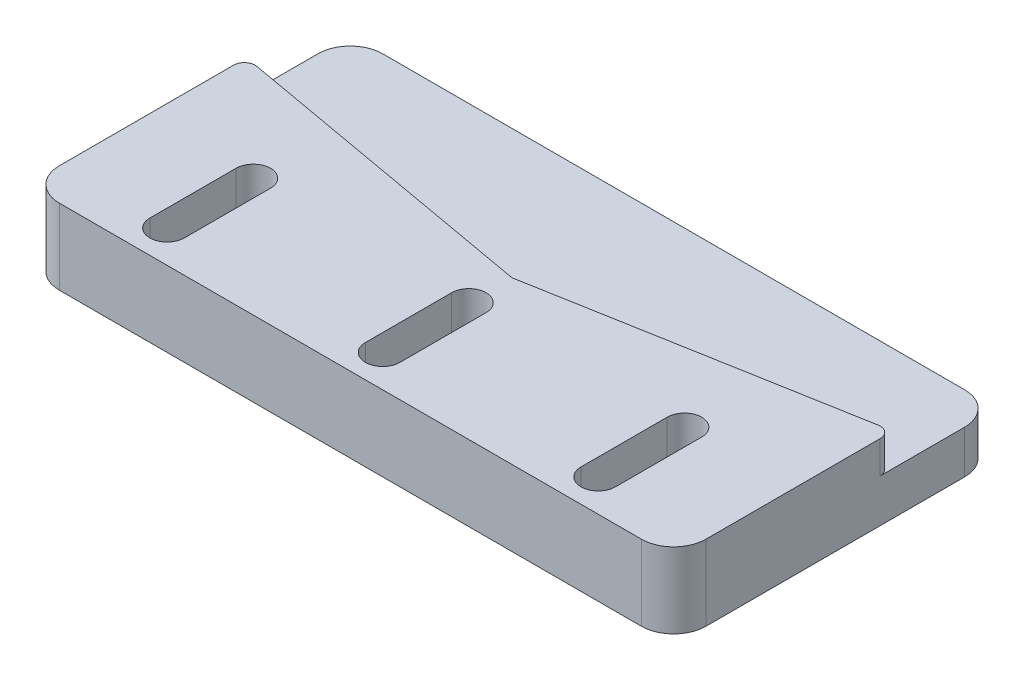
ISO-10303-21;
HEADER;
FILE_DESCRIPTION(('STEP AP214'),'2;1');
FILE_NAME('part.step','',(''),(''),'','','');
FILE_SCHEMA(('AUTOMOTIVE_DESIGN { 1 0 10303 214 1 1 1 1 }'));
ENDSEC;
DATA;
#1=APPLICATION_CONTEXT('core data for automotive mechanical design processes');
#2=APPLICATION_PROTOCOL_DEFINITION('international standard','automotive_design',2000,#1);
#3=PRODUCT_CONTEXT('',#1,'mechanical');
#4=PRODUCT('Part','Part','',(#3));
#5=PRODUCT_RELATED_PRODUCT_CATEGORY('part','',(#4));
#6=PRODUCT_DEFINITION_FORMATION('','',#4);
#7=PRODUCT_DEFINITION_CONTEXT('part definition',#1,'design');
#8=PRODUCT_DEFINITION('design','',#6,#7);
#9=PRODUCT_DEFINITION_SHAPE('','',#8);
#10=(LENGTH_UNIT() NAMED_UNIT(*) SI_UNIT(.MILLI.,.METRE.));
#11=(NAMED_UNIT(*) PLANE_ANGLE_UNIT() SI_UNIT($,.RADIAN.));
#12=(NAMED_UNIT(*) SI_UNIT($,.STERADIAN.) SOLID_ANGLE_UNIT());
#13=UNCERTAINTY_MEASURE_WITH_UNIT(LENGTH_MEASURE(1.E-05),#10,'distance_accuracy_value','');
#14=(GEOMETRIC_REPRESENTATION_CONTEXT(3) GLOBAL_UNCERTAINTY_ASSIGNED_CONTEXT((#13)) GLOBAL_UNIT_ASSIGNED_CONTEXT((#10,
#11,#12)) REPRESENTATION_CONTEXT('',''));
#15=CARTESIAN_POINT('',(0.,0.,0.));
#16=DIRECTION('',(0.,0.,1.));
#17=DIRECTION('',(1.,0.,0.));
#18=AXIS2_PLACEMENT_3D('',#15,#16,#17);
#19=CARTESIAN_POINT('',(29.,3.,-11.664728705991));
#20=DIRECTION('',(0.,-1.,0.));
#21=DIRECTION('',(0.,0.,-1.));
#22=AXIS2_PLACEMENT_3D('',#19,#20,#21);
#23=CYLINDRICAL_SURFACE('',#22,0.999999999999997);
#24=DIRECTION('',(0.,1.,0.));
#25=VECTOR('',#24,1.);
#26=CARTESIAN_POINT('',(28.8241439608693,-63.2978379076744,-12.6491446005708));
#27=LINE('',#26,#25);
#28=CARTESIAN_POINT('',(28.8241439608693,0.,-12.6491446005708));
#29=VERTEX_POINT('',#28);
#30=CARTESIAN_POINT('',(28.8241439608693,3.,-12.6491446005708));
#31=VERTEX_POINT('',#30);
#32=EDGE_CURVE('E207',#29,#31,#27,.T.);
#33=ORIENTED_EDGE('',*,*,#32,.T.);
#34=CARTESIAN_POINT('',(29.,3.,-11.664728705991));
#35=DIRECTION('',(0.,1.,0.));
#36=DIRECTION('',(0.,0.,-1.));
#37=AXIS2_PLACEMENT_3D('',#34,#35,#36);
#38=CIRCLE('',#37,0.999999999999997);
#39=CARTESIAN_POINT('',(30.,3.,-11.664728705991));
#40=VERTEX_POINT('',#39);
#41=EDGE_CURVE('E375',#40,#31,#38,.T.);
#42=ORIENTED_EDGE('',*,*,#41,.F.);
#43=DIRECTION('',(0.,-1.,0.));
#44=VECTOR('',#43,1.);
#45=CARTESIAN_POINT('',(30.,3.,-11.664728705991));
#46=LINE('',#45,#44);
#47=CARTESIAN_POINT('',(30.,0.,-11.664728705991));
#48=VERTEX_POINT('',#47);
#49=EDGE_CURVE('E241',#40,#48,#46,.T.);
#50=ORIENTED_EDGE('',*,*,#49,.T.);
#51=CARTESIAN_POINT('',(29.,0.,-11.664728705991));
#52=DIRECTION('',(0.,1.,0.));
#53=DIRECTION('',(0.,0.,-1.));
#54=AXIS2_PLACEMENT_3D('',#51,#52,#53);
#55=CIRCLE('',#54,0.999999999999997);
#56=EDGE_CURVE('E222',#48,#29,#55,.T.);
#57=ORIENTED_EDGE('',*,*,#56,.T.);
#58=EDGE_LOOP('',(#33,#42,#50,#57));
#59=FACE_BOUND('',#58,.T.);
#60=ADVANCED_FACE('F32',(#59),#23,.T.);
#61=CARTESIAN_POINT('',(-30.,3.,7.5));
#62=DIRECTION('',(1.,0.,0.));
#63=DIRECTION('',(0.,0.,-1.));
#64=AXIS2_PLACEMENT_3D('',#61,#62,#63);
#65=PLANE('',#64);
#66=DIRECTION('',(0.,-1.,0.));
#67=VECTOR('',#66,1.);
#68=CARTESIAN_POINT('',(-30.,3.,4.5));
#69=LINE('',#68,#67);
#70=CARTESIAN_POINT('',(-30.,-4.,4.5));
#71=VERTEX_POINT('',#70);
#72=CARTESIAN_POINT('',(-30.,3.,4.5));
#73=VERTEX_POINT('',#72);
#74=EDGE_CURVE('E11',#71,#73,#69,.F.);
#75=ORIENTED_EDGE('',*,*,#74,.T.);
#76=DIRECTION('',(0.,0.,1.));
#77=VECTOR('',#76,1.);
#78=CARTESIAN_POINT('',(-30.,3.,7.5));
#79=LINE('',#78,#77);
#80=CARTESIAN_POINT('',(-30.,3.,-11.664728705991));
#81=VERTEX_POINT('',#80);
#82=EDGE_CURVE('E221',#81,#73,#79,.T.);
#83=ORIENTED_EDGE('',*,*,#82,.F.);
#84=DIRECTION('',(0.,-1.,0.));
#85=VECTOR('',#84,1.);
#86=CARTESIAN_POINT('',(-30.,3.,-11.664728705991));
#87=LINE('',#86,#85);
#88=CARTESIAN_POINT('',(-30.,0.,-11.664728705991));
#89=VERTEX_POINT('',#88);
#90=EDGE_CURVE('E244',#81,#89,#87,.T.);
#91=ORIENTED_EDGE('',*,*,#90,.T.);
#92=DIRECTION('',(0.,0.,-1.));
#93=VECTOR('',#92,1.);
#94=CARTESIAN_POINT('',(-30.,0.,7.5));
#95=LINE('',#94,#93);
#96=CARTESIAN_POINT('',(-30.,0.,-19.5));
#97=VERTEX_POINT('',#96);
#98=EDGE_CURVE('E219',#89,#97,#95,.T.);
#99=ORIENTED_EDGE('',*,*,#98,.T.);
#100=DIRECTION('',(0.,1.,0.));
#101=VECTOR('',#100,1.);
#102=CARTESIAN_POINT('',(-30.,3.,-19.5));
#103=LINE('',#102,#101);
#104=CARTESIAN_POINT('',(-30.,-4.,-19.5));
#105=VERTEX_POINT('',#104);
#106=EDGE_CURVE('E42',#97,#105,#103,.F.);
#107=ORIENTED_EDGE('',*,*,#106,.T.);
#108=DIRECTION('',(0.,0.,-1.));
#109=VECTOR('',#108,1.);
#110=CARTESIAN_POINT('',(-30.,-4.,7.5));
#111=LINE('',#110,#109);
#112=EDGE_CURVE('E253',#71,#105,#111,.T.);
#113=ORIENTED_EDGE('',*,*,#112,.F.);
#114=EDGE_LOOP('',(#75,#83,#91,#99,#107,#113));
#115=FACE_BOUND('',#114,.T.);
#116=ADVANCED_FACE('F443',(#115),#65,.F.);
#117=CARTESIAN_POINT('',(-30.,3.,7.5));
#118=DIRECTION('',(0.,0.,-1.));
#119=DIRECTION('',(-1.,0.,0.));
#120=AXIS2_PLACEMENT_3D('',#117,#118,#119);
#121=PLANE('',#120);
#122=DIRECTION('',(0.,-1.,0.));
#123=VECTOR('',#122,1.);
#124=CARTESIAN_POINT('',(27.,3.,7.5));
#125=LINE('',#124,#123);
#126=CARTESIAN_POINT('',(27.,-4.,7.5));
#127=VERTEX_POINT('',#126);
#128=CARTESIAN_POINT('',(27.,3.,7.5));
#129=VERTEX_POINT('',#128);
#130=EDGE_CURVE('E395',#127,#129,#125,.F.);
#131=ORIENTED_EDGE('',*,*,#130,.T.);
#132=DIRECTION('',(1.,0.,0.));
#133=VECTOR('',#132,1.);
#134=CARTESIAN_POINT('',(-30.,3.,7.5));
#135=LINE('',#134,#133);
#136=CARTESIAN_POINT('',(-27.,3.,7.5));
#137=VERTEX_POINT('',#136);
#138=EDGE_CURVE('E224',#137,#129,#135,.T.);
#139=ORIENTED_EDGE('',*,*,#138,.F.);
#140=DIRECTION('',(0.,-1.,0.));
#141=VECTOR('',#140,1.);
#142=CARTESIAN_POINT('',(-27.,3.,7.5));
#143=LINE('',#142,#141);
#144=CARTESIAN_POINT('',(-27.,-4.,7.5));
#145=VERTEX_POINT('',#144);
#146=EDGE_CURVE('E401',#137,#145,#143,.T.);
#147=ORIENTED_EDGE('',*,*,#146,.T.);
#148=DIRECTION('',(-1.,0.,0.));
#149=VECTOR('',#148,1.);
#150=CARTESIAN_POINT('',(-30.,-4.,7.5));
#151=LINE('',#150,#149);
#152=EDGE_CURVE('E227',#127,#145,#151,.T.);
#153=ORIENTED_EDGE('',*,*,#152,.F.);
#154=EDGE_LOOP('',(#131,#139,#147,#153));
#155=FACE_BOUND('',#154,.T.);
#156=ADVANCED_FACE('F450',(#155),#121,.F.);
#157=CARTESIAN_POINT('',(30.,3.,7.5));
#158=DIRECTION('',(-1.,0.,0.));
#159=DIRECTION('',(0.,0.,1.));
#160=AXIS2_PLACEMENT_3D('',#157,#158,#159);
#161=PLANE('',#160);
#162=DIRECTION('',(0.,0.,1.));
#163=VECTOR('',#162,1.);
#164=CARTESIAN_POINT('',(30.,0.,7.5));
#165=LINE('',#164,#163);
#166=CARTESIAN_POINT('',(30.,0.,-19.5));
#167=VERTEX_POINT('',#166);
#168=EDGE_CURVE('E250',#167,#48,#165,.T.);
#169=ORIENTED_EDGE('',*,*,#168,.T.);
#170=ORIENTED_EDGE('',*,*,#49,.F.);
#171=DIRECTION('',(0.,0.,-1.));
#172=VECTOR('',#171,1.);
#173=CARTESIAN_POINT('',(30.,3.,7.5));
#174=LINE('',#173,#172);
#175=CARTESIAN_POINT('',(30.,3.,4.5));
#176=VERTEX_POINT('',#175);
#177=EDGE_CURVE('E379',#176,#40,#174,.T.);
#178=ORIENTED_EDGE('',*,*,#177,.F.);
#179=DIRECTION('',(0.,-1.,0.));
#180=VECTOR('',#179,1.);
#181=CARTESIAN_POINT('',(30.,3.,4.5));
#182=LINE('',#181,#180);
#183=CARTESIAN_POINT('',(30.,-4.,4.5));
#184=VERTEX_POINT('',#183);
#185=EDGE_CURVE('E243',#176,#184,#182,.T.);
#186=ORIENTED_EDGE('',*,*,#185,.T.);
#187=DIRECTION('',(0.,0.,1.));
#188=VECTOR('',#187,1.);
#189=CARTESIAN_POINT('',(30.,-4.,7.5));
#190=LINE('',#189,#188);
#191=CARTESIAN_POINT('',(30.,-4.,-19.5));
#192=VERTEX_POINT('',#191);
#193=EDGE_CURVE('E234',#192,#184,#190,.T.);
#194=ORIENTED_EDGE('',*,*,#193,.F.);
#195=DIRECTION('',(0.,1.,0.));
#196=VECTOR('',#195,1.);
#197=CARTESIAN_POINT('',(30.,3.,-19.5));
#198=LINE('',#197,#196);
#199=EDGE_CURVE('E419',#192,#167,#198,.T.);
#200=ORIENTED_EDGE('',*,*,#199,.T.);
#201=EDGE_LOOP('',(#169,#170,#178,#186,#194,#200));
#202=FACE_BOUND('',#201,.T.);
#203=ADVANCED_FACE('F425',(#202),#161,.F.);
#204=CARTESIAN_POINT('',(-29.,3.,-11.664728705991));
#205=DIRECTION('',(0.,-1.,0.));
#206=DIRECTION('',(0.,0.,-1.));
#207=AXIS2_PLACEMENT_3D('',#204,#205,#206);
#208=CYLINDRICAL_SURFACE('',#207,0.999999999999999);
#209=CARTESIAN_POINT('',(-29.,3.,-11.664728705991));
#210=DIRECTION('',(0.,1.,0.));
#211=DIRECTION('',(0.,0.,1.));
#212=AXIS2_PLACEMENT_3D('',#209,#210,#211);
#213=CIRCLE('',#212,0.999999999999999);
#214=CARTESIAN_POINT('',(-28.8241439608693,3.,-12.6491446005708));
#215=VERTEX_POINT('',#214);
#216=EDGE_CURVE('E214',#215,#81,#213,.T.);
#217=ORIENTED_EDGE('',*,*,#216,.F.);
#218=DIRECTION('',(0.,1.,0.));
#219=VECTOR('',#218,1.);
#220=CARTESIAN_POINT('',(-28.8241439608693,-63.2978379076744,-12.6491446005708));
#221=LINE('',#220,#219);
#222=CARTESIAN_POINT('',(-28.8241439608693,0.,-12.6491446005708));
#223=VERTEX_POINT('',#222);
#224=EDGE_CURVE('E202',#223,#215,#221,.T.);
#225=ORIENTED_EDGE('',*,*,#224,.F.);
#226=CARTESIAN_POINT('',(-29.,0.,-11.664728705991));
#227=DIRECTION('',(0.,1.,0.));
#228=DIRECTION('',(0.,0.,1.));
#229=AXIS2_PLACEMENT_3D('',#226,#227,#228);
#230=CIRCLE('',#229,0.999999999999999);
#231=EDGE_CURVE('E36',#223,#89,#230,.T.);
#232=ORIENTED_EDGE('',*,*,#231,.T.);
#233=ORIENTED_EDGE('',*,*,#90,.F.);
#234=EDGE_LOOP('',(#217,#225,#232,#233));
#235=FACE_BOUND('',#234,.T.);
#236=ADVANCED_FACE('F211',(#235),#208,.T.);
#237=CARTESIAN_POINT('',(-29.,3.,-11.664728705991));
#238=DIRECTION('',(0.,1.,0.));
#239=DIRECTION('',(0.,0.,1.));
#240=AXIS2_PLACEMENT_3D('',#237,#238,#239);
#241=PLANE('',#240);
#242=CARTESIAN_POINT('',(-20.,3.,-3.5));
#243=DIRECTION('',(0.,1.,0.));
#244=DIRECTION('',(0.,0.,-1.));
#245=AXIS2_PLACEMENT_3D('',#242,#243,#244);
#246=CIRCLE('',#245,1.6);
#247=CARTESIAN_POINT('',(-18.4,3.,-3.5));
#248=VERTEX_POINT('',#247);
#249=CARTESIAN_POINT('',(-21.6,3.,-3.5));
#250=VERTEX_POINT('',#249);
#251=EDGE_CURVE('E351',#248,#250,#246,.T.);
#252=ORIENTED_EDGE('',*,*,#251,.F.);
#253=DIRECTION('',(0.,0.,-1.));
#254=VECTOR('',#253,1.);
#255=CARTESIAN_POINT('',(-18.4,3.,-3.5));
#256=LINE('',#255,#254);
#257=CARTESIAN_POINT('',(-18.4,3.,4.5));
#258=VERTEX_POINT('',#257);
#259=EDGE_CURVE('E342',#258,#248,#256,.T.);
#260=ORIENTED_EDGE('',*,*,#259,.F.);
#261=CARTESIAN_POINT('',(-20.,3.,4.5));
#262=DIRECTION('',(0.,1.,0.));
#263=DIRECTION('',(0.,0.,-1.));
#264=AXIS2_PLACEMENT_3D('',#261,#262,#263);
#265=CIRCLE('',#264,1.6);
#266=CARTESIAN_POINT('',(-21.6,3.,4.5));
#267=VERTEX_POINT('',#266);
#268=EDGE_CURVE('E346',#267,#258,#265,.T.);
#269=ORIENTED_EDGE('',*,*,#268,.F.);
#270=DIRECTION('',(0.,0.,1.));
#271=VECTOR('',#270,1.);
#272=CARTESIAN_POINT('',(-21.6,3.,-3.5));
#273=LINE('',#272,#271);
#274=EDGE_CURVE('E349',#250,#267,#273,.T.);
#275=ORIENTED_EDGE('',*,*,#274,.F.);
#276=EDGE_LOOP('',(#252,#260,#269,#275));
#277=FACE_BOUND('',#276,.T.);
#278=CARTESIAN_POINT('',(20.,3.,-3.5));
#279=DIRECTION('',(0.,1.,0.));
#280=DIRECTION('',(0.,0.,1.));
#281=AXIS2_PLACEMENT_3D('',#278,#279,#280);
#282=CIRCLE('',#281,1.6);
#283=CARTESIAN_POINT('',(21.6,3.,-3.5));
#284=VERTEX_POINT('',#283);
#285=CARTESIAN_POINT('',(18.4,3.,-3.5));
#286=VERTEX_POINT('',#285);
#287=EDGE_CURVE('E321',#284,#286,#282,.T.);
#288=ORIENTED_EDGE('',*,*,#287,.F.);
#289=DIRECTION('',(0.,0.,-1.));
#290=VECTOR('',#289,1.);
#291=CARTESIAN_POINT('',(21.6,3.,-3.5));
#292=LINE('',#291,#290);
#293=CARTESIAN_POINT('',(21.6,3.,4.5));
#294=VERTEX_POINT('',#293);
#295=EDGE_CURVE('E311',#294,#284,#292,.T.);
#296=ORIENTED_EDGE('',*,*,#295,.F.);
#297=CARTESIAN_POINT('',(20.,3.,4.5));
#298=DIRECTION('',(0.,1.,0.));
#299=DIRECTION('',(0.,0.,1.));
#300=AXIS2_PLACEMENT_3D('',#297,#298,#299);
#301=CIRCLE('',#300,1.6);
#302=CARTESIAN_POINT('',(18.4,3.,4.5));
#303=VERTEX_POINT('',#302);
#304=EDGE_CURVE('E315',#303,#294,#301,.T.);
#305=ORIENTED_EDGE('',*,*,#304,.F.);
#306=DIRECTION('',(0.,0.,1.));
#307=VECTOR('',#306,1.);
#308=CARTESIAN_POINT('',(18.4,3.,-3.5));
#309=LINE('',#308,#307);
#310=EDGE_CURVE('E318',#286,#303,#309,.T.);
#311=ORIENTED_EDGE('',*,*,#310,.F.);
#312=EDGE_LOOP('',(#288,#296,#305,#311));
#313=FACE_BOUND('',#312,.T.);
#314=CARTESIAN_POINT('',(0.,3.,-3.5));
#315=DIRECTION('',(0.,1.,0.));
#316=DIRECTION('',(0.,0.,1.));
#317=AXIS2_PLACEMENT_3D('',#314,#315,#316);
#318=CIRCLE('',#317,1.6);
#319=CARTESIAN_POINT('',(1.6,3.,-3.5));
#320=VERTEX_POINT('',#319);
#321=CARTESIAN_POINT('',(-1.6,3.,-3.5));
#322=VERTEX_POINT('',#321);
#323=EDGE_CURVE('E289',#320,#322,#318,.T.);
#324=ORIENTED_EDGE('',*,*,#323,.F.);
#325=DIRECTION('',(0.,0.,-1.));
#326=VECTOR('',#325,1.);
#327=CARTESIAN_POINT('',(1.6,3.,-3.5));
#328=LINE('',#327,#326);
#329=CARTESIAN_POINT('',(1.6,3.,4.5));
#330=VERTEX_POINT('',#329);
#331=EDGE_CURVE('E279',#330,#320,#328,.T.);
#332=ORIENTED_EDGE('',*,*,#331,.F.);
#333=CARTESIAN_POINT('',(0.,3.,4.5));
#334=DIRECTION('',(0.,1.,0.));
#335=DIRECTION('',(0.,0.,1.));
#336=AXIS2_PLACEMENT_3D('',#333,#334,#335);
#337=CIRCLE('',#336,1.6);
#338=CARTESIAN_POINT('',(-1.6,3.,4.5));
#339=VERTEX_POINT('',#338);
#340=EDGE_CURVE('E283',#339,#330,#337,.T.);
#341=ORIENTED_EDGE('',*,*,#340,.F.);
#342=DIRECTION('',(0.,0.,1.));
#343=VECTOR('',#342,1.);
#344=CARTESIAN_POINT('',(-1.6,3.,-3.5));
#345=LINE('',#344,#343);
#346=EDGE_CURVE('E286',#322,#339,#345,.T.);
#347=ORIENTED_EDGE('',*,*,#346,.F.);
#348=EDGE_LOOP('',(#324,#332,#341,#347));
#349=FACE_BOUND('',#348,.T.);
#350=ORIENTED_EDGE('',*,*,#138,.T.);
#351=CARTESIAN_POINT('',(27.,3.,4.5));
#352=DIRECTION('',(0.,1.,0.));
#353=DIRECTION('',(0.,0.,1.));
#354=AXIS2_PLACEMENT_3D('',#351,#352,#353);
#355=CIRCLE('',#354,3.);
#356=EDGE_CURVE('E384',#129,#176,#355,.T.);
#357=ORIENTED_EDGE('',*,*,#356,.T.);
#358=ORIENTED_EDGE('',*,*,#177,.T.);
#359=ORIENTED_EDGE('',*,*,#41,.T.);
#360=DIRECTION('',(-0.984415894579757,0.,0.175856039130694));
#361=VECTOR('',#360,1.);
#362=CARTESIAN_POINT('',(0.,3.,-7.5));
#363=LINE('',#362,#361);
#364=CARTESIAN_POINT('',(0.,3.,-7.5));
#365=VERTEX_POINT('',#364);
#366=EDGE_CURVE('E215',#31,#365,#363,.T.);
#367=ORIENTED_EDGE('',*,*,#366,.T.);
#368=DIRECTION('',(-0.984415894579757,0.,-0.175856039130694));
#369=VECTOR('',#368,1.);
#370=CARTESIAN_POINT('',(0.,3.,-7.5));
#371=LINE('',#370,#369);
#372=EDGE_CURVE('E353',#365,#215,#371,.T.);
#373=ORIENTED_EDGE('',*,*,#372,.T.);
#374=ORIENTED_EDGE('',*,*,#216,.T.);
#375=ORIENTED_EDGE('',*,*,#82,.T.);
#376=CARTESIAN_POINT('',(-27.,3.,4.5));
#377=DIRECTION('',(0.,1.,0.));
#378=DIRECTION('',(0.,0.,1.));
#379=AXIS2_PLACEMENT_3D('',#376,#377,#378);
#380=CIRCLE('',#379,3.);
#381=EDGE_CURVE('E387',#73,#137,#380,.T.);
#382=ORIENTED_EDGE('',*,*,#381,.T.);
#383=EDGE_LOOP('',(#350,#357,#358,#359,#367,#373,#374,#375,#382));
#384=FACE_BOUND('',#383,.T.);
#385=ADVANCED_FACE('F372',(#277,#313,#349,#384),#241,.T.);
#386=CARTESIAN_POINT('',(-30.,-4.,-22.5));
#387=DIRECTION('',(0.,0.,1.));
#388=DIRECTION('',(1.,0.,0.));
#389=AXIS2_PLACEMENT_3D('',#386,#387,#388);
#390=PLANE('',#389);
#391=DIRECTION('',(1.,0.,0.));
#392=VECTOR('',#391,1.);
#393=CARTESIAN_POINT('',(-30.,0.,-22.5));
#394=LINE('',#393,#392);
#395=CARTESIAN_POINT('',(-27.,0.,-22.5));
#396=VERTEX_POINT('',#395);
#397=CARTESIAN_POINT('',(27.,0.,-22.5));
#398=VERTEX_POINT('',#397);
#399=EDGE_CURVE('E254',#396,#398,#394,.T.);
#400=ORIENTED_EDGE('',*,*,#399,.T.);
#401=DIRECTION('',(0.,1.,0.));
#402=VECTOR('',#401,1.);
#403=CARTESIAN_POINT('',(27.,-4.,-22.5));
#404=LINE('',#403,#402);
#405=CARTESIAN_POINT('',(27.,-4.,-22.5));
#406=VERTEX_POINT('',#405);
#407=EDGE_CURVE('E411',#398,#406,#404,.F.);
#408=ORIENTED_EDGE('',*,*,#407,.T.);
#409=DIRECTION('',(1.,0.,0.));
#410=VECTOR('',#409,1.);
#411=CARTESIAN_POINT('',(-30.,-4.,-22.5));
#412=LINE('',#411,#410);
#413=CARTESIAN_POINT('',(-27.,-4.,-22.5));
#414=VERTEX_POINT('',#413);
#415=EDGE_CURVE('E266',#414,#406,#412,.T.);
#416=ORIENTED_EDGE('',*,*,#415,.F.);
#417=DIRECTION('',(0.,1.,0.));
#418=VECTOR('',#417,1.);
#419=CARTESIAN_POINT('',(-27.,-4.,-22.5));
#420=LINE('',#419,#418);
#421=EDGE_CURVE('E413',#414,#396,#420,.T.);
#422=ORIENTED_EDGE('',*,*,#421,.T.);
#423=EDGE_LOOP('',(#400,#408,#416,#422));
#424=FACE_BOUND('',#423,.T.);
#425=ADVANCED_FACE('F437',(#424),#390,.F.);
#426=CARTESIAN_POINT('',(0.,-4.,0.));
#427=DIRECTION('',(0.,-1.,0.));
#428=DIRECTION('',(0.,0.,-1.));
#429=AXIS2_PLACEMENT_3D('',#426,#427,#428);
#430=PLANE('',#429);
#431=CARTESIAN_POINT('',(-20.,-4.,-3.5));
#432=DIRECTION('',(0.,1.,0.));
#433=DIRECTION('',(0.,0.,-1.));
#434=AXIS2_PLACEMENT_3D('',#431,#432,#433);
#435=CIRCLE('',#434,1.6);
#436=CARTESIAN_POINT('',(-18.4,-4.,-3.5));
#437=VERTEX_POINT('',#436);
#438=CARTESIAN_POINT('',(-21.6,-4.,-3.5));
#439=VERTEX_POINT('',#438);
#440=EDGE_CURVE('E345',#437,#439,#435,.T.);
#441=ORIENTED_EDGE('',*,*,#440,.T.);
#442=DIRECTION('',(0.,0.,1.));
#443=VECTOR('',#442,1.);
#444=CARTESIAN_POINT('',(-21.6,-4.,-3.5));
#445=LINE('',#444,#443);
#446=CARTESIAN_POINT('',(-21.6,-4.,4.5));
#447=VERTEX_POINT('',#446);
#448=EDGE_CURVE('E359',#439,#447,#445,.T.);
#449=ORIENTED_EDGE('',*,*,#448,.T.);
#450=CARTESIAN_POINT('',(-20.,-4.,4.5));
#451=DIRECTION('',(0.,1.,0.));
#452=DIRECTION('',(0.,0.,-1.));
#453=AXIS2_PLACEMENT_3D('',#450,#451,#452);
#454=CIRCLE('',#453,1.6);
#455=CARTESIAN_POINT('',(-18.4,-4.,4.5));
#456=VERTEX_POINT('',#455);
#457=EDGE_CURVE('E356',#447,#456,#454,.T.);
#458=ORIENTED_EDGE('',*,*,#457,.T.);
#459=DIRECTION('',(0.,0.,-1.));
#460=VECTOR('',#459,1.);
#461=CARTESIAN_POINT('',(-18.4,-4.,-3.5));
#462=LINE('',#461,#460);
#463=EDGE_CURVE('E337',#456,#437,#462,.T.);
#464=ORIENTED_EDGE('',*,*,#463,.T.);
#465=EDGE_LOOP('',(#441,#449,#458,#464));
#466=FACE_BOUND('',#465,.T.);
#467=CARTESIAN_POINT('',(20.,-4.,-3.5));
#468=DIRECTION('',(0.,1.,0.));
#469=DIRECTION('',(0.,0.,1.));
#470=AXIS2_PLACEMENT_3D('',#467,#468,#469);
#471=CIRCLE('',#470,1.6);
#472=CARTESIAN_POINT('',(21.6,-4.,-3.5));
#473=VERTEX_POINT('',#472);
#474=CARTESIAN_POINT('',(18.4,-4.,-3.5));
#475=VERTEX_POINT('',#474);
#476=EDGE_CURVE('E314',#473,#475,#471,.T.);
#477=ORIENTED_EDGE('',*,*,#476,.T.);
#478=DIRECTION('',(0.,0.,1.));
#479=VECTOR('',#478,1.);
#480=CARTESIAN_POINT('',(18.4,-4.,-3.5));
#481=LINE('',#480,#479);
#482=CARTESIAN_POINT('',(18.4,-4.,4.5));
#483=VERTEX_POINT('',#482);
#484=EDGE_CURVE('E330',#475,#483,#481,.T.);
#485=ORIENTED_EDGE('',*,*,#484,.T.);
#486=CARTESIAN_POINT('',(20.,-4.,4.5));
#487=DIRECTION('',(0.,1.,0.));
#488=DIRECTION('',(0.,0.,1.));
#489=AXIS2_PLACEMENT_3D('',#486,#487,#488);
#490=CIRCLE('',#489,1.6);
#491=CARTESIAN_POINT('',(21.6,-4.,4.5));
#492=VERTEX_POINT('',#491);
#493=EDGE_CURVE('E327',#483,#492,#490,.T.);
#494=ORIENTED_EDGE('',*,*,#493,.T.);
#495=DIRECTION('',(0.,0.,-1.));
#496=VECTOR('',#495,1.);
#497=CARTESIAN_POINT('',(21.6,-4.,-3.5));
#498=LINE('',#497,#496);
#499=EDGE_CURVE('E306',#492,#473,#498,.T.);
#500=ORIENTED_EDGE('',*,*,#499,.T.);
#501=EDGE_LOOP('',(#477,#485,#494,#500));
#502=FACE_BOUND('',#501,.T.);
#503=CARTESIAN_POINT('',(0.,-4.,-3.5));
#504=DIRECTION('',(0.,1.,0.));
#505=DIRECTION('',(0.,0.,1.));
#506=AXIS2_PLACEMENT_3D('',#503,#504,#505);
#507=CIRCLE('',#506,1.6);
#508=CARTESIAN_POINT('',(1.6,-4.,-3.5));
#509=VERTEX_POINT('',#508);
#510=CARTESIAN_POINT('',(-1.6,-4.,-3.5));
#511=VERTEX_POINT('',#510);
#512=EDGE_CURVE('E282',#509,#511,#507,.T.);
#513=ORIENTED_EDGE('',*,*,#512,.T.);
#514=DIRECTION('',(0.,0.,1.));
#515=VECTOR('',#514,1.);
#516=CARTESIAN_POINT('',(-1.6,-4.,-3.5));
#517=LINE('',#516,#515);
#518=CARTESIAN_POINT('',(-1.6,-4.,4.5));
#519=VERTEX_POINT('',#518);
#520=EDGE_CURVE('E298',#511,#519,#517,.T.);
#521=ORIENTED_EDGE('',*,*,#520,.T.);
#522=CARTESIAN_POINT('',(0.,-4.,4.5));
#523=DIRECTION('',(0.,1.,0.));
#524=DIRECTION('',(0.,0.,1.));
#525=AXIS2_PLACEMENT_3D('',#522,#523,#524);
#526=CIRCLE('',#525,1.6);
#527=CARTESIAN_POINT('',(1.6,-4.,4.5));
#528=VERTEX_POINT('',#527);
#529=EDGE_CURVE('E295',#519,#528,#526,.T.);
#530=ORIENTED_EDGE('',*,*,#529,.T.);
#531=DIRECTION('',(0.,0.,-1.));
#532=VECTOR('',#531,1.);
#533=CARTESIAN_POINT('',(1.6,-4.,-3.5));
#534=LINE('',#533,#532);
#535=EDGE_CURVE('E274',#528,#509,#534,.T.);
#536=ORIENTED_EDGE('',*,*,#535,.T.);
#537=EDGE_LOOP('',(#513,#521,#530,#536));
#538=FACE_BOUND('',#537,.T.);
#539=ORIENTED_EDGE('',*,*,#415,.T.);
#540=CARTESIAN_POINT('',(27.,-4.,-19.5));
#541=DIRECTION('',(0.,-1.,0.));
#542=DIRECTION('',(0.,0.,-1.));
#543=AXIS2_PLACEMENT_3D('',#540,#541,#542);
#544=CIRCLE('',#543,3.);
#545=EDGE_CURVE('E403',#406,#192,#544,.T.);
#546=ORIENTED_EDGE('',*,*,#545,.T.);
#547=ORIENTED_EDGE('',*,*,#193,.T.);
#548=CARTESIAN_POINT('',(27.,-4.,4.5));
#549=DIRECTION('',(0.,-1.,0.));
#550=DIRECTION('',(0.,0.,-1.));
#551=AXIS2_PLACEMENT_3D('',#548,#549,#550);
#552=CIRCLE('',#551,3.);
#553=EDGE_CURVE('E405',#184,#127,#552,.T.);
#554=ORIENTED_EDGE('',*,*,#553,.T.);
#555=ORIENTED_EDGE('',*,*,#152,.T.);
#556=CARTESIAN_POINT('',(-27.,-4.,4.5));
#557=DIRECTION('',(0.,-1.,0.));
#558=DIRECTION('',(0.,0.,-1.));
#559=AXIS2_PLACEMENT_3D('',#556,#557,#558);
#560=CIRCLE('',#559,3.);
#561=EDGE_CURVE('E407',#145,#71,#560,.T.);
#562=ORIENTED_EDGE('',*,*,#561,.T.);
#563=ORIENTED_EDGE('',*,*,#112,.T.);
#564=CARTESIAN_POINT('',(-27.,-4.,-19.5));
#565=DIRECTION('',(0.,-1.,0.));
#566=DIRECTION('',(0.,0.,-1.));
#567=AXIS2_PLACEMENT_3D('',#564,#565,#566);
#568=CIRCLE('',#567,3.);
#569=EDGE_CURVE('E409',#105,#414,#568,.T.);
#570=ORIENTED_EDGE('',*,*,#569,.T.);
#571=EDGE_LOOP('',(#539,#546,#547,#554,#555,#562,#563,#570));
#572=FACE_BOUND('',#571,.T.);
#573=ADVANCED_FACE('F428',(#466,#502,#538,#572),#430,.T.);
#574=CARTESIAN_POINT('',(0.,0.,0.));
#575=DIRECTION('',(0.,-1.,0.));
#576=DIRECTION('',(0.,0.,-1.));
#577=AXIS2_PLACEMENT_3D('',#574,#575,#576);
#578=PLANE('',#577);
#579=DIRECTION('',(-0.984415894579757,0.,-0.175856039130694));
#580=VECTOR('',#579,1.);
#581=CARTESIAN_POINT('',(0.,0.,-7.5));
#582=LINE('',#581,#580);
#583=CARTESIAN_POINT('',(0.,0.,-7.5));
#584=VERTEX_POINT('',#583);
#585=EDGE_CURVE('E199',#584,#223,#582,.T.);
#586=ORIENTED_EDGE('',*,*,#585,.F.);
#587=DIRECTION('',(-0.984415894579757,0.,0.175856039130694));
#588=VECTOR('',#587,1.);
#589=CARTESIAN_POINT('',(0.,0.,-7.5));
#590=LINE('',#589,#588);
#591=EDGE_CURVE('E364',#29,#584,#590,.T.);
#592=ORIENTED_EDGE('',*,*,#591,.F.);
#593=ORIENTED_EDGE('',*,*,#56,.F.);
#594=ORIENTED_EDGE('',*,*,#168,.F.);
#595=CARTESIAN_POINT('',(27.,0.,-19.5));
#596=DIRECTION('',(0.,-1.,0.));
#597=DIRECTION('',(0.,0.,-1.));
#598=AXIS2_PLACEMENT_3D('',#595,#596,#597);
#599=CIRCLE('',#598,3.);
#600=EDGE_CURVE('E416',#167,#398,#599,.F.);
#601=ORIENTED_EDGE('',*,*,#600,.T.);
#602=ORIENTED_EDGE('',*,*,#399,.F.);
#603=CARTESIAN_POINT('',(-27.,0.,-19.5));
#604=DIRECTION('',(0.,-1.,0.));
#605=DIRECTION('',(0.,0.,-1.));
#606=AXIS2_PLACEMENT_3D('',#603,#604,#605);
#607=CIRCLE('',#606,3.);
#608=EDGE_CURVE('E418',#396,#97,#607,.F.);
#609=ORIENTED_EDGE('',*,*,#608,.T.);
#610=ORIENTED_EDGE('',*,*,#98,.F.);
#611=ORIENTED_EDGE('',*,*,#231,.F.);
#612=EDGE_LOOP('',(#586,#592,#593,#594,#601,#602,#609,#610,#611));
#613=FACE_BOUND('',#612,.T.);
#614=ADVANCED_FACE('F217',(#613),#578,.F.);
#615=CARTESIAN_POINT('',(27.,3.,-19.5));
#616=DIRECTION('',(0.,1.,0.));
#617=DIRECTION('',(0.,0.,1.));
#618=AXIS2_PLACEMENT_3D('',#615,#616,#617);
#619=CYLINDRICAL_SURFACE('',#618,3.);
#620=ORIENTED_EDGE('',*,*,#545,.F.);
#621=ORIENTED_EDGE('',*,*,#407,.F.);
#622=ORIENTED_EDGE('',*,*,#600,.F.);
#623=ORIENTED_EDGE('',*,*,#199,.F.);
#624=EDGE_LOOP('',(#620,#621,#622,#623));
#625=FACE_BOUND('',#624,.T.);
#626=ADVANCED_FACE('F433',(#625),#619,.T.);
#627=CARTESIAN_POINT('',(27.,3.,4.5));
#628=DIRECTION('',(0.,-1.,0.));
#629=DIRECTION('',(0.,0.,-1.));
#630=AXIS2_PLACEMENT_3D('',#627,#628,#629);
#631=CYLINDRICAL_SURFACE('',#630,3.);
#632=ORIENTED_EDGE('',*,*,#553,.F.);
#633=ORIENTED_EDGE('',*,*,#185,.F.);
#634=ORIENTED_EDGE('',*,*,#356,.F.);
#635=ORIENTED_EDGE('',*,*,#130,.F.);
#636=EDGE_LOOP('',(#632,#633,#634,#635));
#637=FACE_BOUND('',#636,.T.);
#638=ADVANCED_FACE('F394',(#637),#631,.T.);
#639=CARTESIAN_POINT('',(-27.,3.,4.5));
#640=DIRECTION('',(0.,-1.,0.));
#641=DIRECTION('',(0.,0.,-1.));
#642=AXIS2_PLACEMENT_3D('',#639,#640,#641);
#643=CYLINDRICAL_SURFACE('',#642,3.);
#644=ORIENTED_EDGE('',*,*,#561,.F.);
#645=ORIENTED_EDGE('',*,*,#146,.F.);
#646=ORIENTED_EDGE('',*,*,#381,.F.);
#647=ORIENTED_EDGE('',*,*,#74,.F.);
#648=EDGE_LOOP('',(#644,#645,#646,#647));
#649=FACE_BOUND('',#648,.T.);
#650=ADVANCED_FACE('F449',(#649),#643,.T.);
#651=CARTESIAN_POINT('',(-27.,-4.,-19.5));
#652=DIRECTION('',(0.,1.,0.));
#653=DIRECTION('',(0.,0.,1.));
#654=AXIS2_PLACEMENT_3D('',#651,#652,#653);
#655=CYLINDRICAL_SURFACE('',#654,3.);
#656=ORIENTED_EDGE('',*,*,#569,.F.);
#657=ORIENTED_EDGE('',*,*,#106,.F.);
#658=ORIENTED_EDGE('',*,*,#608,.F.);
#659=ORIENTED_EDGE('',*,*,#421,.F.);
#660=EDGE_LOOP('',(#656,#657,#658,#659));
#661=FACE_BOUND('',#660,.T.);
#662=ADVANCED_FACE('F34',(#661),#655,.T.);
#663=CARTESIAN_POINT('',(0.,-4.,-3.5));
#664=DIRECTION('',(0.,1.,0.));
#665=DIRECTION('',(0.,0.,1.));
#666=AXIS2_PLACEMENT_3D('',#663,#664,#665);
#667=CYLINDRICAL_SURFACE('',#666,1.6);
#668=DIRECTION('',(0.,1.,0.));
#669=VECTOR('',#668,1.);
#670=CARTESIAN_POINT('',(1.6,-4.,-3.5));
#671=LINE('',#670,#669);
#672=EDGE_CURVE('E260',#509,#320,#671,.T.);
#673=ORIENTED_EDGE('',*,*,#672,.T.);
#674=ORIENTED_EDGE('',*,*,#323,.T.);
#675=DIRECTION('',(0.,1.,0.));
#676=VECTOR('',#675,1.);
#677=CARTESIAN_POINT('',(-1.6,-4.,-3.5));
#678=LINE('',#677,#676);
#679=EDGE_CURVE('E271',#511,#322,#678,.T.);
#680=ORIENTED_EDGE('',*,*,#679,.F.);
#681=ORIENTED_EDGE('',*,*,#512,.F.);
#682=EDGE_LOOP('',(#673,#674,#680,#681));
#683=FACE_BOUND('',#682,.T.);
#684=ADVANCED_FACE('F476',(#683),#667,.F.);
#685=CARTESIAN_POINT('',(1.6,-4.,-3.5));
#686=DIRECTION('',(1.,0.,0.));
#687=DIRECTION('',(0.,0.,-1.));
#688=AXIS2_PLACEMENT_3D('',#685,#686,#687);
#689=PLANE('',#688);
#690=DIRECTION('',(0.,1.,0.));
#691=VECTOR('',#690,1.);
#692=CARTESIAN_POINT('',(1.6,-4.,4.5));
#693=LINE('',#692,#691);
#694=EDGE_CURVE('E276',#528,#330,#693,.T.);
#695=ORIENTED_EDGE('',*,*,#694,.T.);
#696=ORIENTED_EDGE('',*,*,#331,.T.);
#697=ORIENTED_EDGE('',*,*,#672,.F.);
#698=ORIENTED_EDGE('',*,*,#535,.F.);
#699=EDGE_LOOP('',(#695,#696,#697,#698));
#700=FACE_BOUND('',#699,.T.);
#701=ADVANCED_FACE('F479',(#700),#689,.F.);
#702=CARTESIAN_POINT('',(0.,-4.,4.5));
#703=DIRECTION('',(0.,1.,0.));
#704=DIRECTION('',(0.,0.,1.));
#705=AXIS2_PLACEMENT_3D('',#702,#703,#704);
#706=CYLINDRICAL_SURFACE('',#705,1.6);
#707=DIRECTION('',(0.,1.,0.));
#708=VECTOR('',#707,1.);
#709=CARTESIAN_POINT('',(-1.6,-4.,4.5));
#710=LINE('',#709,#708);
#711=EDGE_CURVE('E273',#519,#339,#710,.T.);
#712=ORIENTED_EDGE('',*,*,#711,.T.);
#713=ORIENTED_EDGE('',*,*,#340,.T.);
#714=ORIENTED_EDGE('',*,*,#694,.F.);
#715=ORIENTED_EDGE('',*,*,#529,.F.);
#716=EDGE_LOOP('',(#712,#713,#714,#715));
#717=FACE_BOUND('',#716,.T.);
#718=ADVANCED_FACE('F485',(#717),#706,.F.);
#719=CARTESIAN_POINT('',(-1.6,-4.,-3.5));
#720=DIRECTION('',(-1.,0.,0.));
#721=DIRECTION('',(0.,0.,1.));
#722=AXIS2_PLACEMENT_3D('',#719,#720,#721);
#723=PLANE('',#722);
#724=ORIENTED_EDGE('',*,*,#679,.T.);
#725=ORIENTED_EDGE('',*,*,#346,.T.);
#726=ORIENTED_EDGE('',*,*,#711,.F.);
#727=ORIENTED_EDGE('',*,*,#520,.F.);
#728=EDGE_LOOP('',(#724,#725,#726,#727));
#729=FACE_BOUND('',#728,.T.);
#730=ADVANCED_FACE('F481',(#729),#723,.F.);
#731=CARTESIAN_POINT('',(20.,-4.,-3.5));
#732=DIRECTION('',(0.,1.,0.));
#733=DIRECTION('',(0.,0.,1.));
#734=AXIS2_PLACEMENT_3D('',#731,#732,#733);
#735=CYLINDRICAL_SURFACE('',#734,1.6);
#736=DIRECTION('',(0.,1.,0.));
#737=VECTOR('',#736,1.);
#738=CARTESIAN_POINT('',(21.6,-4.,-3.5));
#739=LINE('',#738,#737);
#740=EDGE_CURVE('E292',#473,#284,#739,.T.);
#741=ORIENTED_EDGE('',*,*,#740,.T.);
#742=ORIENTED_EDGE('',*,*,#287,.T.);
#743=DIRECTION('',(0.,1.,0.));
#744=VECTOR('',#743,1.);
#745=CARTESIAN_POINT('',(18.4,-4.,-3.5));
#746=LINE('',#745,#744);
#747=EDGE_CURVE('E303',#475,#286,#746,.T.);
#748=ORIENTED_EDGE('',*,*,#747,.F.);
#749=ORIENTED_EDGE('',*,*,#476,.F.);
#750=EDGE_LOOP('',(#741,#742,#748,#749));
#751=FACE_BOUND('',#750,.T.);
#752=ADVANCED_FACE('F484',(#751),#735,.F.);
#753=CARTESIAN_POINT('',(21.6,-4.,-3.5));
#754=DIRECTION('',(1.,0.,0.));
#755=DIRECTION('',(0.,0.,-1.));
#756=AXIS2_PLACEMENT_3D('',#753,#754,#755);
#757=PLANE('',#756);
#758=DIRECTION('',(0.,1.,0.));
#759=VECTOR('',#758,1.);
#760=CARTESIAN_POINT('',(21.6,-4.,4.5));
#761=LINE('',#760,#759);
#762=EDGE_CURVE('E308',#492,#294,#761,.T.);
#763=ORIENTED_EDGE('',*,*,#762,.T.);
#764=ORIENTED_EDGE('',*,*,#295,.T.);
#765=ORIENTED_EDGE('',*,*,#740,.F.);
#766=ORIENTED_EDGE('',*,*,#499,.F.);
#767=EDGE_LOOP('',(#763,#764,#765,#766));
#768=FACE_BOUND('',#767,.T.);
#769=ADVANCED_FACE('F495',(#768),#757,.F.);
#770=CARTESIAN_POINT('',(20.,-4.,4.5));
#771=DIRECTION('',(0.,1.,0.));
#772=DIRECTION('',(0.,0.,1.));
#773=AXIS2_PLACEMENT_3D('',#770,#771,#772);
#774=CYLINDRICAL_SURFACE('',#773,1.6);
#775=DIRECTION('',(0.,1.,0.));
#776=VECTOR('',#775,1.);
#777=CARTESIAN_POINT('',(18.4,-4.,4.5));
#778=LINE('',#777,#776);
#779=EDGE_CURVE('E305',#483,#303,#778,.T.);
#780=ORIENTED_EDGE('',*,*,#779,.T.);
#781=ORIENTED_EDGE('',*,*,#304,.T.);
#782=ORIENTED_EDGE('',*,*,#762,.F.);
#783=ORIENTED_EDGE('',*,*,#493,.F.);
#784=EDGE_LOOP('',(#780,#781,#782,#783));
#785=FACE_BOUND('',#784,.T.);
#786=ADVANCED_FACE('F501',(#785),#774,.F.);
#787=CARTESIAN_POINT('',(18.4,-4.,-3.5));
#788=DIRECTION('',(-1.,0.,0.));
#789=DIRECTION('',(0.,0.,1.));
#790=AXIS2_PLACEMENT_3D('',#787,#788,#789);
#791=PLANE('',#790);
#792=ORIENTED_EDGE('',*,*,#747,.T.);
#793=ORIENTED_EDGE('',*,*,#310,.T.);
#794=ORIENTED_EDGE('',*,*,#779,.F.);
#795=ORIENTED_EDGE('',*,*,#484,.F.);
#796=EDGE_LOOP('',(#792,#793,#794,#795));
#797=FACE_BOUND('',#796,.T.);
#798=ADVANCED_FACE('F497',(#797),#791,.F.);
#799=CARTESIAN_POINT('',(-20.,-4.,-3.5));
#800=DIRECTION('',(0.,1.,0.));
#801=DIRECTION('',(0.,0.,1.));
#802=AXIS2_PLACEMENT_3D('',#799,#800,#801);
#803=CYLINDRICAL_SURFACE('',#802,1.6);
#804=DIRECTION('',(0.,1.,0.));
#805=VECTOR('',#804,1.);
#806=CARTESIAN_POINT('',(-18.4,-4.,-3.5));
#807=LINE('',#806,#805);
#808=EDGE_CURVE('E324',#437,#248,#807,.T.);
#809=ORIENTED_EDGE('',*,*,#808,.T.);
#810=ORIENTED_EDGE('',*,*,#251,.T.);
#811=DIRECTION('',(0.,1.,0.));
#812=VECTOR('',#811,1.);
#813=CARTESIAN_POINT('',(-21.6,-4.,-3.5));
#814=LINE('',#813,#812);
#815=EDGE_CURVE('E57',#439,#250,#814,.T.);
#816=ORIENTED_EDGE('',*,*,#815,.F.);
#817=ORIENTED_EDGE('',*,*,#440,.F.);
#818=EDGE_LOOP('',(#809,#810,#816,#817));
#819=FACE_BOUND('',#818,.T.);
#820=ADVANCED_FACE('F500',(#819),#803,.F.);
#821=CARTESIAN_POINT('',(-18.4,-4.,-3.5));
#822=DIRECTION('',(1.,0.,0.));
#823=DIRECTION('',(0.,0.,-1.));
#824=AXIS2_PLACEMENT_3D('',#821,#822,#823);
#825=PLANE('',#824);
#826=DIRECTION('',(0.,1.,0.));
#827=VECTOR('',#826,1.);
#828=CARTESIAN_POINT('',(-18.4,-4.,4.5));
#829=LINE('',#828,#827);
#830=EDGE_CURVE('E339',#456,#258,#829,.T.);
#831=ORIENTED_EDGE('',*,*,#830,.T.);
#832=ORIENTED_EDGE('',*,*,#259,.T.);
#833=ORIENTED_EDGE('',*,*,#808,.F.);
#834=ORIENTED_EDGE('',*,*,#463,.F.);
#835=EDGE_LOOP('',(#831,#832,#833,#834));
#836=FACE_BOUND('',#835,.T.);
#837=ADVANCED_FACE('F511',(#836),#825,.F.);
#838=CARTESIAN_POINT('',(-20.,-4.,4.5));
#839=DIRECTION('',(0.,1.,0.));
#840=DIRECTION('',(0.,0.,1.));
#841=AXIS2_PLACEMENT_3D('',#838,#839,#840);
#842=CYLINDRICAL_SURFACE('',#841,1.6);
#843=DIRECTION('',(0.,1.,0.));
#844=VECTOR('',#843,1.);
#845=CARTESIAN_POINT('',(-21.6,-4.,4.5));
#846=LINE('',#845,#844);
#847=EDGE_CURVE('E336',#447,#267,#846,.T.);
#848=ORIENTED_EDGE('',*,*,#847,.T.);
#849=ORIENTED_EDGE('',*,*,#268,.T.);
#850=ORIENTED_EDGE('',*,*,#830,.F.);
#851=ORIENTED_EDGE('',*,*,#457,.F.);
#852=EDGE_LOOP('',(#848,#849,#850,#851));
#853=FACE_BOUND('',#852,.T.);
#854=ADVANCED_FACE('F516',(#853),#842,.F.);
#855=CARTESIAN_POINT('',(-21.6,-4.,-3.5));
#856=DIRECTION('',(-1.,0.,0.));
#857=DIRECTION('',(0.,0.,1.));
#858=AXIS2_PLACEMENT_3D('',#855,#856,#857);
#859=PLANE('',#858);
#860=ORIENTED_EDGE('',*,*,#815,.T.);
#861=ORIENTED_EDGE('',*,*,#274,.T.);
#862=ORIENTED_EDGE('',*,*,#847,.F.);
#863=ORIENTED_EDGE('',*,*,#448,.F.);
#864=EDGE_LOOP('',(#860,#861,#862,#863));
#865=FACE_BOUND('',#864,.T.);
#866=ADVANCED_FACE('F513',(#865),#859,.F.);
#867=CARTESIAN_POINT('',(0.,-63.2978379076744,-7.5));
#868=DIRECTION('',(-0.175856039130694,0.,-0.984415894579758));
#869=DIRECTION('',(-0.984415894579757,0.,0.175856039130694));
#870=AXIS2_PLACEMENT_3D('',#867,#868,#869);
#871=PLANE('',#870);
#872=ORIENTED_EDGE('',*,*,#32,.F.);
#873=ORIENTED_EDGE('',*,*,#591,.T.);
#874=DIRECTION('',(0.,1.,0.));
#875=VECTOR('',#874,1.);
#876=CARTESIAN_POINT('',(0.,-63.2978379076744,-7.5));
#877=LINE('',#876,#875);
#878=EDGE_CURVE('E49',#584,#365,#877,.T.);
#879=ORIENTED_EDGE('',*,*,#878,.T.);
#880=ORIENTED_EDGE('',*,*,#366,.F.);
#881=EDGE_LOOP('',(#872,#873,#879,#880));
#882=FACE_BOUND('',#881,.T.);
#883=ADVANCED_FACE('F377',(#882),#871,.T.);
#884=CARTESIAN_POINT('',(0.,-63.2978379076744,-7.5));
#885=DIRECTION('',(0.175856039130694,0.,-0.984415894579757));
#886=DIRECTION('',(-0.984415894579757,0.,-0.175856039130694));
#887=AXIS2_PLACEMENT_3D('',#884,#885,#886);
#888=PLANE('',#887);
#889=ORIENTED_EDGE('',*,*,#878,.F.);
#890=ORIENTED_EDGE('',*,*,#585,.T.);
#891=ORIENTED_EDGE('',*,*,#224,.T.);
#892=ORIENTED_EDGE('',*,*,#372,.F.);
#893=EDGE_LOOP('',(#889,#890,#891,#892));
#894=FACE_BOUND('',#893,.T.);
#895=ADVANCED_FACE('F201',(#894),#888,.T.);
#896=CLOSED_SHELL('',(#60,#116,#156,#203,#236,#385,#425,#573,#614,#626,#638,#650,#662,#684,#701,
#718,#730,#752,#769,#786,#798,#820,#837,#854,#866,#883,#895));
#897=MANIFOLD_SOLID_BREP('B2',#896);
#898=ADVANCED_BREP_SHAPE_REPRESENTATION('',(#18,#897),#14);
#899=SHAPE_DEFINITION_REPRESENTATION(#9,#898);
ENDSEC;
END-ISO-10303-21;
